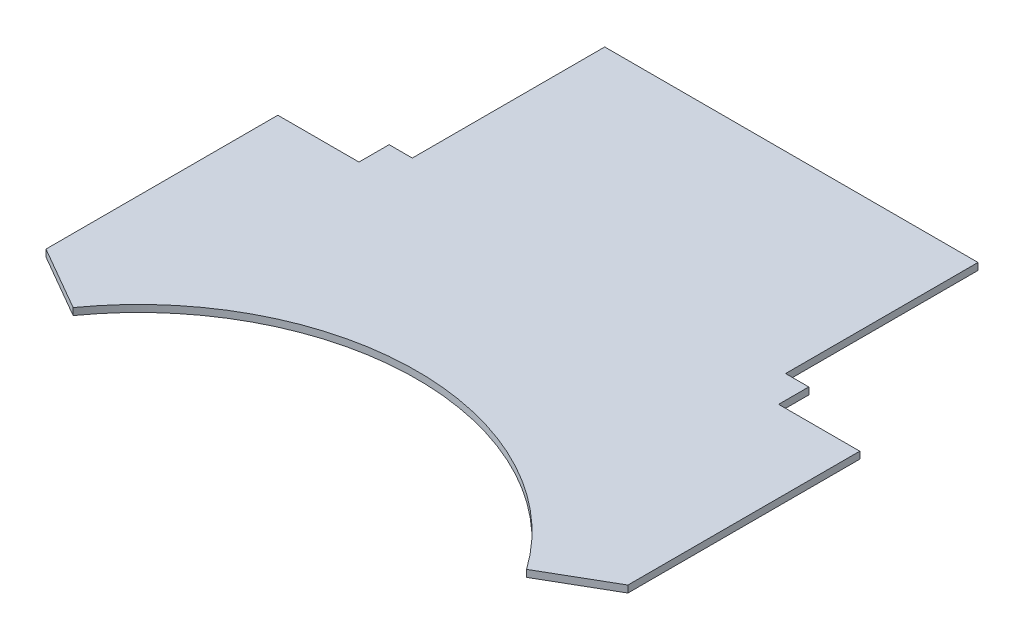
ISO-10303-21;
HEADER;
FILE_DESCRIPTION(('STEP AP214'),'2;1');
FILE_NAME('part.step','',(''),(''),'','','');
FILE_SCHEMA(('AUTOMOTIVE_DESIGN { 1 0 10303 214 1 1 1 1 }'));
ENDSEC;
DATA;
#1=APPLICATION_CONTEXT('core data for automotive mechanical design processes');
#2=APPLICATION_PROTOCOL_DEFINITION('international standard','automotive_design',2000,#1);
#3=PRODUCT_CONTEXT('',#1,'mechanical');
#4=PRODUCT('Part','Part','',(#3));
#5=PRODUCT_RELATED_PRODUCT_CATEGORY('part','',(#4));
#6=PRODUCT_DEFINITION_FORMATION('','',#4);
#7=PRODUCT_DEFINITION_CONTEXT('part definition',#1,'design');
#8=PRODUCT_DEFINITION('design','',#6,#7);
#9=PRODUCT_DEFINITION_SHAPE('','',#8);
#10=(LENGTH_UNIT() NAMED_UNIT(*) SI_UNIT(.MILLI.,.METRE.));
#11=(NAMED_UNIT(*) PLANE_ANGLE_UNIT() SI_UNIT($,.RADIAN.));
#12=(NAMED_UNIT(*) SI_UNIT($,.STERADIAN.) SOLID_ANGLE_UNIT());
#13=UNCERTAINTY_MEASURE_WITH_UNIT(LENGTH_MEASURE(1.E-05),#10,'distance_accuracy_value','');
#14=(GEOMETRIC_REPRESENTATION_CONTEXT(3) GLOBAL_UNCERTAINTY_ASSIGNED_CONTEXT((#13)) GLOBAL_UNIT_ASSIGNED_CONTEXT((#10,
#11,#12)) REPRESENTATION_CONTEXT('',''));
#15=CARTESIAN_POINT('',(0.,0.,0.));
#16=DIRECTION('',(0.,0.,1.));
#17=DIRECTION('',(1.,0.,0.));
#18=AXIS2_PLACEMENT_3D('',#15,#16,#17);
#19=CARTESIAN_POINT('',(-80.5,3.,0.));
#20=DIRECTION('',(1.,0.,0.));
#21=DIRECTION('',(0.,0.,-1.));
#22=AXIS2_PLACEMENT_3D('',#19,#20,#21);
#23=PLANE('',#22);
#24=DIRECTION('',(0.,0.,1.));
#25=VECTOR('',#24,1.);
#26=CARTESIAN_POINT('',(-80.5,0.,0.));
#27=LINE('',#26,#25);
#28=CARTESIAN_POINT('',(-80.5,0.,0.));
#29=VERTEX_POINT('',#28);
#30=CARTESIAN_POINT('',(-80.5,0.,83.));
#31=VERTEX_POINT('',#30);
#32=EDGE_CURVE('E163',#29,#31,#27,.T.);
#33=ORIENTED_EDGE('',*,*,#32,.T.);
#34=DIRECTION('',(0.,-1.,0.));
#35=VECTOR('',#34,1.);
#36=CARTESIAN_POINT('',(-80.5,3.,83.));
#37=LINE('',#36,#35);
#38=CARTESIAN_POINT('',(-80.5,3.,83.));
#39=VERTEX_POINT('',#38);
#40=EDGE_CURVE('E11',#39,#31,#37,.T.);
#41=ORIENTED_EDGE('',*,*,#40,.F.);
#42=DIRECTION('',(0.,0.,1.));
#43=VECTOR('',#42,1.);
#44=CARTESIAN_POINT('',(-80.5,3.,0.));
#45=LINE('',#44,#43);
#46=CARTESIAN_POINT('',(-80.5,3.,0.));
#47=VERTEX_POINT('',#46);
#48=EDGE_CURVE('E189',#47,#39,#45,.T.);
#49=ORIENTED_EDGE('',*,*,#48,.F.);
#50=DIRECTION('',(0.,-1.,0.));
#51=VECTOR('',#50,1.);
#52=CARTESIAN_POINT('',(-80.5,3.,0.));
#53=LINE('',#52,#51);
#54=EDGE_CURVE('E159',#47,#29,#53,.T.);
#55=ORIENTED_EDGE('',*,*,#54,.T.);
#56=EDGE_LOOP('',(#33,#41,#49,#55));
#57=FACE_BOUND('',#56,.T.);
#58=ADVANCED_FACE('F31',(#57),#23,.F.);
#59=CARTESIAN_POINT('',(-80.5,3.,83.));
#60=DIRECTION('',(0.,0.,1.));
#61=DIRECTION('',(1.,0.,0.));
#62=AXIS2_PLACEMENT_3D('',#59,#60,#61);
#63=PLANE('',#62);
#64=DIRECTION('',(-1.,0.,0.));
#65=VECTOR('',#64,1.);
#66=CARTESIAN_POINT('',(-80.5,0.,83.));
#67=LINE('',#66,#65);
#68=CARTESIAN_POINT('',(-90.5,0.,83.));
#69=VERTEX_POINT('',#68);
#70=EDGE_CURVE('E166',#31,#69,#67,.T.);
#71=ORIENTED_EDGE('',*,*,#70,.T.);
#72=DIRECTION('',(0.,-1.,0.));
#73=VECTOR('',#72,1.);
#74=CARTESIAN_POINT('',(-90.5,3.,83.));
#75=LINE('',#74,#73);
#76=CARTESIAN_POINT('',(-90.5,3.,83.));
#77=VERTEX_POINT('',#76);
#78=EDGE_CURVE('E39',#77,#69,#75,.T.);
#79=ORIENTED_EDGE('',*,*,#78,.F.);
#80=DIRECTION('',(-1.,0.,0.));
#81=VECTOR('',#80,1.);
#82=CARTESIAN_POINT('',(-80.5,3.,83.));
#83=LINE('',#82,#81);
#84=EDGE_CURVE('E108',#39,#77,#83,.T.);
#85=ORIENTED_EDGE('',*,*,#84,.F.);
#86=ORIENTED_EDGE('',*,*,#40,.T.);
#87=EDGE_LOOP('',(#71,#79,#85,#86));
#88=FACE_BOUND('',#87,.T.);
#89=ADVANCED_FACE('F277',(#88),#63,.F.);
#90=CARTESIAN_POINT('',(-90.5,3.,83.));
#91=DIRECTION('',(1.,0.,0.));
#92=DIRECTION('',(0.,0.,-1.));
#93=AXIS2_PLACEMENT_3D('',#90,#91,#92);
#94=PLANE('',#93);
#95=DIRECTION('',(0.,0.,1.));
#96=VECTOR('',#95,1.);
#97=CARTESIAN_POINT('',(-90.5,0.,83.));
#98=LINE('',#97,#96);
#99=CARTESIAN_POINT('',(-90.5,0.,96.));
#100=VERTEX_POINT('',#99);
#101=EDGE_CURVE('E168',#69,#100,#98,.T.);
#102=ORIENTED_EDGE('',*,*,#101,.T.);
#103=DIRECTION('',(0.,-1.,0.));
#104=VECTOR('',#103,1.);
#105=CARTESIAN_POINT('',(-90.5,3.,96.));
#106=LINE('',#105,#104);
#107=CARTESIAN_POINT('',(-90.5,3.,96.));
#108=VERTEX_POINT('',#107);
#109=EDGE_CURVE('E214',#108,#100,#106,.T.);
#110=ORIENTED_EDGE('',*,*,#109,.F.);
#111=DIRECTION('',(0.,0.,1.));
#112=VECTOR('',#111,1.);
#113=CARTESIAN_POINT('',(-90.5,3.,83.));
#114=LINE('',#113,#112);
#115=EDGE_CURVE('E222',#77,#108,#114,.T.);
#116=ORIENTED_EDGE('',*,*,#115,.F.);
#117=ORIENTED_EDGE('',*,*,#78,.T.);
#118=EDGE_LOOP('',(#102,#110,#116,#117));
#119=FACE_BOUND('',#118,.T.);
#120=ADVANCED_FACE('F220',(#119),#94,.F.);
#121=CARTESIAN_POINT('',(-90.5,3.,96.));
#122=DIRECTION('',(0.,0.,1.));
#123=DIRECTION('',(1.,0.,0.));
#124=AXIS2_PLACEMENT_3D('',#121,#122,#123);
#125=PLANE('',#124);
#126=DIRECTION('',(-1.,0.,0.));
#127=VECTOR('',#126,1.);
#128=CARTESIAN_POINT('',(-90.5,0.,96.));
#129=LINE('',#128,#127);
#130=CARTESIAN_POINT('',(-125.5,0.,96.));
#131=VERTEX_POINT('',#130);
#132=EDGE_CURVE('E170',#100,#131,#129,.T.);
#133=ORIENTED_EDGE('',*,*,#132,.T.);
#134=DIRECTION('',(0.,-1.,0.));
#135=VECTOR('',#134,1.);
#136=CARTESIAN_POINT('',(-125.5,3.,96.));
#137=LINE('',#136,#135);
#138=CARTESIAN_POINT('',(-125.5,3.,96.));
#139=VERTEX_POINT('',#138);
#140=EDGE_CURVE('E211',#139,#131,#137,.T.);
#141=ORIENTED_EDGE('',*,*,#140,.F.);
#142=DIRECTION('',(-1.,0.,0.));
#143=VECTOR('',#142,1.);
#144=CARTESIAN_POINT('',(-90.5,3.,96.));
#145=LINE('',#144,#143);
#146=EDGE_CURVE('E240',#108,#139,#145,.T.);
#147=ORIENTED_EDGE('',*,*,#146,.F.);
#148=ORIENTED_EDGE('',*,*,#109,.T.);
#149=EDGE_LOOP('',(#133,#141,#147,#148));
#150=FACE_BOUND('',#149,.T.);
#151=ADVANCED_FACE('F231',(#150),#125,.F.);
#152=CARTESIAN_POINT('',(-125.5,3.,96.));
#153=DIRECTION('',(1.,0.,0.));
#154=DIRECTION('',(0.,0.,-1.));
#155=AXIS2_PLACEMENT_3D('',#152,#153,#154);
#156=PLANE('',#155);
#157=DIRECTION('',(0.,0.,1.));
#158=VECTOR('',#157,1.);
#159=CARTESIAN_POINT('',(-125.5,0.,96.));
#160=LINE('',#159,#158);
#161=CARTESIAN_POINT('',(-125.5,0.,196.));
#162=VERTEX_POINT('',#161);
#163=EDGE_CURVE('E172',#131,#162,#160,.T.);
#164=ORIENTED_EDGE('',*,*,#163,.T.);
#165=DIRECTION('',(0.,-1.,0.));
#166=VECTOR('',#165,1.);
#167=CARTESIAN_POINT('',(-125.5,3.,196.));
#168=LINE('',#167,#166);
#169=CARTESIAN_POINT('',(-125.5,3.,196.));
#170=VERTEX_POINT('',#169);
#171=EDGE_CURVE('E208',#170,#162,#168,.T.);
#172=ORIENTED_EDGE('',*,*,#171,.F.);
#173=DIRECTION('',(0.,0.,1.));
#174=VECTOR('',#173,1.);
#175=CARTESIAN_POINT('',(-125.5,3.,96.));
#176=LINE('',#175,#174);
#177=EDGE_CURVE('E237',#139,#170,#176,.T.);
#178=ORIENTED_EDGE('',*,*,#177,.F.);
#179=ORIENTED_EDGE('',*,*,#140,.T.);
#180=EDGE_LOOP('',(#164,#172,#178,#179));
#181=FACE_BOUND('',#180,.T.);
#182=ADVANCED_FACE('F235',(#181),#156,.F.);
#183=CARTESIAN_POINT('',(-125.5,3.,196.));
#184=DIRECTION('',(0.499999999999997,0.,-0.86602540378444));
#185=DIRECTION('',(-0.86602540378444,0.,-0.499999999999997));
#186=AXIS2_PLACEMENT_3D('',#183,#184,#185);
#187=PLANE('',#186);
#188=DIRECTION('',(0.86602540378444,0.,0.499999999999997));
#189=VECTOR('',#188,1.);
#190=CARTESIAN_POINT('',(-125.5,0.,196.));
#191=LINE('',#190,#189);
#192=CARTESIAN_POINT('',(-97.7871870788979,0.,212.));
#193=VERTEX_POINT('',#192);
#194=EDGE_CURVE('E174',#162,#193,#191,.T.);
#195=ORIENTED_EDGE('',*,*,#194,.T.);
#196=DIRECTION('',(0.,-1.,0.));
#197=VECTOR('',#196,1.);
#198=CARTESIAN_POINT('',(-97.7871870788979,3.,212.));
#199=LINE('',#198,#197);
#200=CARTESIAN_POINT('',(-97.7871870788979,3.,212.));
#201=VERTEX_POINT('',#200);
#202=EDGE_CURVE('E205',#201,#193,#199,.T.);
#203=ORIENTED_EDGE('',*,*,#202,.F.);
#204=DIRECTION('',(0.86602540378444,0.,0.499999999999997));
#205=VECTOR('',#204,1.);
#206=CARTESIAN_POINT('',(-125.5,3.,196.));
#207=LINE('',#206,#205);
#208=EDGE_CURVE('E239',#170,#201,#207,.T.);
#209=ORIENTED_EDGE('',*,*,#208,.F.);
#210=ORIENTED_EDGE('',*,*,#171,.T.);
#211=EDGE_LOOP('',(#195,#203,#209,#210));
#212=FACE_BOUND('',#211,.T.);
#213=ADVANCED_FACE('F290',(#212),#187,.F.);
#214=CARTESIAN_POINT('',(0.,3.,281.553332365866));
#215=DIRECTION('',(0.,-1.,0.));
#216=DIRECTION('',(0.,0.,-1.));
#217=AXIS2_PLACEMENT_3D('',#214,#215,#216);
#218=CYLINDRICAL_SURFACE('',#217,120.);
#219=CARTESIAN_POINT('',(0.,0.,281.553332365866));
#220=DIRECTION('',(0.,-1.,0.));
#221=DIRECTION('',(0.,0.,-1.));
#222=AXIS2_PLACEMENT_3D('',#219,#220,#221);
#223=CIRCLE('',#222,120.);
#224=CARTESIAN_POINT('',(97.7871870788979,0.,212.));
#225=VERTEX_POINT('',#224);
#226=EDGE_CURVE('E176',#193,#225,#223,.T.);
#227=ORIENTED_EDGE('',*,*,#226,.T.);
#228=DIRECTION('',(0.,-1.,0.));
#229=VECTOR('',#228,1.);
#230=CARTESIAN_POINT('',(97.7871870788979,3.,212.));
#231=LINE('',#230,#229);
#232=CARTESIAN_POINT('',(97.7871870788979,3.,212.));
#233=VERTEX_POINT('',#232);
#234=EDGE_CURVE('E202',#233,#225,#231,.T.);
#235=ORIENTED_EDGE('',*,*,#234,.F.);
#236=CARTESIAN_POINT('',(0.,3.,281.553332365866));
#237=DIRECTION('',(0.,-1.,0.));
#238=DIRECTION('',(0.,0.,-1.));
#239=AXIS2_PLACEMENT_3D('',#236,#237,#238);
#240=CIRCLE('',#239,120.);
#241=EDGE_CURVE('E242',#201,#233,#240,.T.);
#242=ORIENTED_EDGE('',*,*,#241,.F.);
#243=ORIENTED_EDGE('',*,*,#202,.T.);
#244=EDGE_LOOP('',(#227,#235,#242,#243));
#245=FACE_BOUND('',#244,.T.);
#246=ADVANCED_FACE('F293',(#245),#218,.F.);
#247=CARTESIAN_POINT('',(125.5,3.,196.));
#248=DIRECTION('',(-0.5,0.,-0.866025403784439));
#249=DIRECTION('',(-0.866025403784439,0.,0.5));
#250=AXIS2_PLACEMENT_3D('',#247,#248,#249);
#251=PLANE('',#250);
#252=DIRECTION('',(0.866025403784439,0.,-0.5));
#253=VECTOR('',#252,1.);
#254=CARTESIAN_POINT('',(125.5,0.,196.));
#255=LINE('',#254,#253);
#256=CARTESIAN_POINT('',(125.5,0.,196.));
#257=VERTEX_POINT('',#256);
#258=EDGE_CURVE('E178',#225,#257,#255,.T.);
#259=ORIENTED_EDGE('',*,*,#258,.T.);
#260=DIRECTION('',(0.,-1.,0.));
#261=VECTOR('',#260,1.);
#262=CARTESIAN_POINT('',(125.5,3.,196.));
#263=LINE('',#262,#261);
#264=CARTESIAN_POINT('',(125.5,3.,196.));
#265=VERTEX_POINT('',#264);
#266=EDGE_CURVE('E199',#265,#257,#263,.T.);
#267=ORIENTED_EDGE('',*,*,#266,.F.);
#268=DIRECTION('',(0.866025403784439,0.,-0.5));
#269=VECTOR('',#268,1.);
#270=CARTESIAN_POINT('',(125.5,3.,196.));
#271=LINE('',#270,#269);
#272=EDGE_CURVE('E248',#233,#265,#271,.T.);
#273=ORIENTED_EDGE('',*,*,#272,.F.);
#274=ORIENTED_EDGE('',*,*,#234,.T.);
#275=EDGE_LOOP('',(#259,#267,#273,#274));
#276=FACE_BOUND('',#275,.T.);
#277=ADVANCED_FACE('F297',(#276),#251,.F.);
#278=CARTESIAN_POINT('',(125.5,3.,96.));
#279=DIRECTION('',(-1.,0.,0.));
#280=DIRECTION('',(0.,0.,1.));
#281=AXIS2_PLACEMENT_3D('',#278,#279,#280);
#282=PLANE('',#281);
#283=DIRECTION('',(0.,0.,-1.));
#284=VECTOR('',#283,1.);
#285=CARTESIAN_POINT('',(125.5,0.,96.));
#286=LINE('',#285,#284);
#287=CARTESIAN_POINT('',(125.5,0.,96.));
#288=VERTEX_POINT('',#287);
#289=EDGE_CURVE('E180',#257,#288,#286,.T.);
#290=ORIENTED_EDGE('',*,*,#289,.T.);
#291=DIRECTION('',(0.,-1.,0.));
#292=VECTOR('',#291,1.);
#293=CARTESIAN_POINT('',(125.5,3.,96.));
#294=LINE('',#293,#292);
#295=CARTESIAN_POINT('',(125.5,3.,96.));
#296=VERTEX_POINT('',#295);
#297=EDGE_CURVE('E196',#296,#288,#294,.T.);
#298=ORIENTED_EDGE('',*,*,#297,.F.);
#299=DIRECTION('',(0.,0.,-1.));
#300=VECTOR('',#299,1.);
#301=CARTESIAN_POINT('',(125.5,3.,96.));
#302=LINE('',#301,#300);
#303=EDGE_CURVE('E250',#265,#296,#302,.T.);
#304=ORIENTED_EDGE('',*,*,#303,.F.);
#305=ORIENTED_EDGE('',*,*,#266,.T.);
#306=EDGE_LOOP('',(#290,#298,#304,#305));
#307=FACE_BOUND('',#306,.T.);
#308=ADVANCED_FACE('F301',(#307),#282,.F.);
#309=CARTESIAN_POINT('',(90.5,3.,96.));
#310=DIRECTION('',(0.,0.,1.));
#311=DIRECTION('',(1.,0.,0.));
#312=AXIS2_PLACEMENT_3D('',#309,#310,#311);
#313=PLANE('',#312);
#314=DIRECTION('',(-1.,0.,0.));
#315=VECTOR('',#314,1.);
#316=CARTESIAN_POINT('',(90.5,0.,96.));
#317=LINE('',#316,#315);
#318=CARTESIAN_POINT('',(90.5,0.,96.));
#319=VERTEX_POINT('',#318);
#320=EDGE_CURVE('E182',#288,#319,#317,.T.);
#321=ORIENTED_EDGE('',*,*,#320,.T.);
#322=DIRECTION('',(0.,-1.,0.));
#323=VECTOR('',#322,1.);
#324=CARTESIAN_POINT('',(90.5,3.,96.));
#325=LINE('',#324,#323);
#326=CARTESIAN_POINT('',(90.5,3.,96.));
#327=VERTEX_POINT('',#326);
#328=EDGE_CURVE('E193',#327,#319,#325,.T.);
#329=ORIENTED_EDGE('',*,*,#328,.F.);
#330=DIRECTION('',(-1.,0.,0.));
#331=VECTOR('',#330,1.);
#332=CARTESIAN_POINT('',(90.5,3.,96.));
#333=LINE('',#332,#331);
#334=EDGE_CURVE('E252',#296,#327,#333,.T.);
#335=ORIENTED_EDGE('',*,*,#334,.F.);
#336=ORIENTED_EDGE('',*,*,#297,.T.);
#337=EDGE_LOOP('',(#321,#329,#335,#336));
#338=FACE_BOUND('',#337,.T.);
#339=ADVANCED_FACE('F258',(#338),#313,.F.);
#340=CARTESIAN_POINT('',(90.5,3.,83.));
#341=DIRECTION('',(-1.,0.,0.));
#342=DIRECTION('',(0.,0.,1.));
#343=AXIS2_PLACEMENT_3D('',#340,#341,#342);
#344=PLANE('',#343);
#345=DIRECTION('',(0.,0.,-1.));
#346=VECTOR('',#345,1.);
#347=CARTESIAN_POINT('',(90.5,0.,83.));
#348=LINE('',#347,#346);
#349=CARTESIAN_POINT('',(90.5,0.,83.));
#350=VERTEX_POINT('',#349);
#351=EDGE_CURVE('E184',#319,#350,#348,.T.);
#352=ORIENTED_EDGE('',*,*,#351,.T.);
#353=DIRECTION('',(0.,-1.,0.));
#354=VECTOR('',#353,1.);
#355=CARTESIAN_POINT('',(90.5,3.,83.));
#356=LINE('',#355,#354);
#357=CARTESIAN_POINT('',(90.5,3.,83.));
#358=VERTEX_POINT('',#357);
#359=EDGE_CURVE('E154',#358,#350,#356,.T.);
#360=ORIENTED_EDGE('',*,*,#359,.F.);
#361=DIRECTION('',(0.,0.,-1.));
#362=VECTOR('',#361,1.);
#363=CARTESIAN_POINT('',(90.5,3.,83.));
#364=LINE('',#363,#362);
#365=EDGE_CURVE('E145',#327,#358,#364,.T.);
#366=ORIENTED_EDGE('',*,*,#365,.F.);
#367=ORIENTED_EDGE('',*,*,#328,.T.);
#368=EDGE_LOOP('',(#352,#360,#366,#367));
#369=FACE_BOUND('',#368,.T.);
#370=ADVANCED_FACE('F262',(#369),#344,.F.);
#371=CARTESIAN_POINT('',(80.5,3.,83.));
#372=DIRECTION('',(0.,0.,1.));
#373=DIRECTION('',(1.,0.,0.));
#374=AXIS2_PLACEMENT_3D('',#371,#372,#373);
#375=PLANE('',#374);
#376=DIRECTION('',(-1.,0.,0.));
#377=VECTOR('',#376,1.);
#378=CARTESIAN_POINT('',(80.5,0.,83.));
#379=LINE('',#378,#377);
#380=CARTESIAN_POINT('',(80.5,0.,83.));
#381=VERTEX_POINT('',#380);
#382=EDGE_CURVE('E153',#350,#381,#379,.T.);
#383=ORIENTED_EDGE('',*,*,#382,.T.);
#384=DIRECTION('',(0.,-1.,0.));
#385=VECTOR('',#384,1.);
#386=CARTESIAN_POINT('',(80.5,3.,83.));
#387=LINE('',#386,#385);
#388=CARTESIAN_POINT('',(80.5,3.,83.));
#389=VERTEX_POINT('',#388);
#390=EDGE_CURVE('E150',#389,#381,#387,.T.);
#391=ORIENTED_EDGE('',*,*,#390,.F.);
#392=DIRECTION('',(-1.,0.,0.));
#393=VECTOR('',#392,1.);
#394=CARTESIAN_POINT('',(80.5,3.,83.));
#395=LINE('',#394,#393);
#396=EDGE_CURVE('E139',#358,#389,#395,.T.);
#397=ORIENTED_EDGE('',*,*,#396,.F.);
#398=ORIENTED_EDGE('',*,*,#359,.T.);
#399=EDGE_LOOP('',(#383,#391,#397,#398));
#400=FACE_BOUND('',#399,.T.);
#401=ADVANCED_FACE('F151',(#400),#375,.F.);
#402=CARTESIAN_POINT('',(80.5,3.,0.));
#403=DIRECTION('',(-1.,0.,0.));
#404=DIRECTION('',(0.,0.,1.));
#405=AXIS2_PLACEMENT_3D('',#402,#403,#404);
#406=PLANE('',#405);
#407=DIRECTION('',(0.,0.,-1.));
#408=VECTOR('',#407,1.);
#409=CARTESIAN_POINT('',(80.5,0.,0.));
#410=LINE('',#409,#408);
#411=CARTESIAN_POINT('',(80.5,0.,0.));
#412=VERTEX_POINT('',#411);
#413=EDGE_CURVE('E94',#381,#412,#410,.T.);
#414=ORIENTED_EDGE('',*,*,#413,.T.);
#415=DIRECTION('',(0.,-1.,0.));
#416=VECTOR('',#415,1.);
#417=CARTESIAN_POINT('',(80.5,3.,0.));
#418=LINE('',#417,#416);
#419=CARTESIAN_POINT('',(80.5,3.,0.));
#420=VERTEX_POINT('',#419);
#421=EDGE_CURVE('E155',#420,#412,#418,.T.);
#422=ORIENTED_EDGE('',*,*,#421,.F.);
#423=DIRECTION('',(0.,0.,-1.));
#424=VECTOR('',#423,1.);
#425=CARTESIAN_POINT('',(80.5,3.,0.));
#426=LINE('',#425,#424);
#427=EDGE_CURVE('E143',#389,#420,#426,.T.);
#428=ORIENTED_EDGE('',*,*,#427,.F.);
#429=ORIENTED_EDGE('',*,*,#390,.T.);
#430=EDGE_LOOP('',(#414,#422,#428,#429));
#431=FACE_BOUND('',#430,.T.);
#432=ADVANCED_FACE('F157',(#431),#406,.F.);
#433=CARTESIAN_POINT('',(80.5,3.,0.));
#434=DIRECTION('',(0.,0.,1.));
#435=DIRECTION('',(1.,0.,0.));
#436=AXIS2_PLACEMENT_3D('',#433,#434,#435);
#437=PLANE('',#436);
#438=DIRECTION('',(-1.,0.,0.));
#439=VECTOR('',#438,1.);
#440=CARTESIAN_POINT('',(80.5,0.,0.));
#441=LINE('',#440,#439);
#442=EDGE_CURVE('E100',#412,#29,#441,.T.);
#443=ORIENTED_EDGE('',*,*,#442,.T.);
#444=ORIENTED_EDGE('',*,*,#54,.F.);
#445=DIRECTION('',(-1.,0.,0.));
#446=VECTOR('',#445,1.);
#447=CARTESIAN_POINT('',(80.5,3.,0.));
#448=LINE('',#447,#446);
#449=EDGE_CURVE('E47',#420,#47,#448,.T.);
#450=ORIENTED_EDGE('',*,*,#449,.F.);
#451=ORIENTED_EDGE('',*,*,#421,.T.);
#452=EDGE_LOOP('',(#443,#444,#450,#451));
#453=FACE_BOUND('',#452,.T.);
#454=ADVANCED_FACE('F266',(#453),#437,.F.);
#455=CARTESIAN_POINT('',(0.,3.,281.553332365866));
#456=DIRECTION('',(0.,-1.,0.));
#457=DIRECTION('',(0.,0.,-1.));
#458=AXIS2_PLACEMENT_3D('',#455,#456,#457);
#459=PLANE('',#458);
#460=ORIENTED_EDGE('',*,*,#48,.T.);
#461=ORIENTED_EDGE('',*,*,#84,.T.);
#462=ORIENTED_EDGE('',*,*,#115,.T.);
#463=ORIENTED_EDGE('',*,*,#146,.T.);
#464=ORIENTED_EDGE('',*,*,#177,.T.);
#465=ORIENTED_EDGE('',*,*,#208,.T.);
#466=ORIENTED_EDGE('',*,*,#241,.T.);
#467=ORIENTED_EDGE('',*,*,#272,.T.);
#468=ORIENTED_EDGE('',*,*,#303,.T.);
#469=ORIENTED_EDGE('',*,*,#334,.T.);
#470=ORIENTED_EDGE('',*,*,#365,.T.);
#471=ORIENTED_EDGE('',*,*,#396,.T.);
#472=ORIENTED_EDGE('',*,*,#427,.T.);
#473=ORIENTED_EDGE('',*,*,#449,.T.);
#474=EDGE_LOOP('',(#460,#461,#462,#463,#464,#465,#466,#467,#468,#469,#470,#471,#472,#473));
#475=FACE_BOUND('',#474,.T.);
#476=ADVANCED_FACE('F141',(#475),#459,.F.);
#477=CARTESIAN_POINT('',(0.,0.,281.553332365866));
#478=DIRECTION('',(0.,-1.,0.));
#479=DIRECTION('',(0.,0.,-1.));
#480=AXIS2_PLACEMENT_3D('',#477,#478,#479);
#481=PLANE('',#480);
#482=ORIENTED_EDGE('',*,*,#32,.F.);
#483=ORIENTED_EDGE('',*,*,#442,.F.);
#484=ORIENTED_EDGE('',*,*,#413,.F.);
#485=ORIENTED_EDGE('',*,*,#382,.F.);
#486=ORIENTED_EDGE('',*,*,#351,.F.);
#487=ORIENTED_EDGE('',*,*,#320,.F.);
#488=ORIENTED_EDGE('',*,*,#289,.F.);
#489=ORIENTED_EDGE('',*,*,#258,.F.);
#490=ORIENTED_EDGE('',*,*,#226,.F.);
#491=ORIENTED_EDGE('',*,*,#194,.F.);
#492=ORIENTED_EDGE('',*,*,#163,.F.);
#493=ORIENTED_EDGE('',*,*,#132,.F.);
#494=ORIENTED_EDGE('',*,*,#101,.F.);
#495=ORIENTED_EDGE('',*,*,#70,.F.);
#496=EDGE_LOOP('',(#482,#483,#484,#485,#486,#487,#488,#489,#490,#491,#492,#493,#494,#495));
#497=FACE_BOUND('',#496,.T.);
#498=ADVANCED_FACE('F226',(#497),#481,.T.);
#499=CLOSED_SHELL('',(#58,#89,#120,#151,#182,#213,#246,#277,#308,#339,#370,#401,#432,#454,#476,#498));
#500=MANIFOLD_SOLID_BREP('B2',#499);
#501=ADVANCED_BREP_SHAPE_REPRESENTATION('',(#18,#500),#14);
#502=SHAPE_DEFINITION_REPRESENTATION(#9,#501);
ENDSEC;
END-ISO-10303-21;
